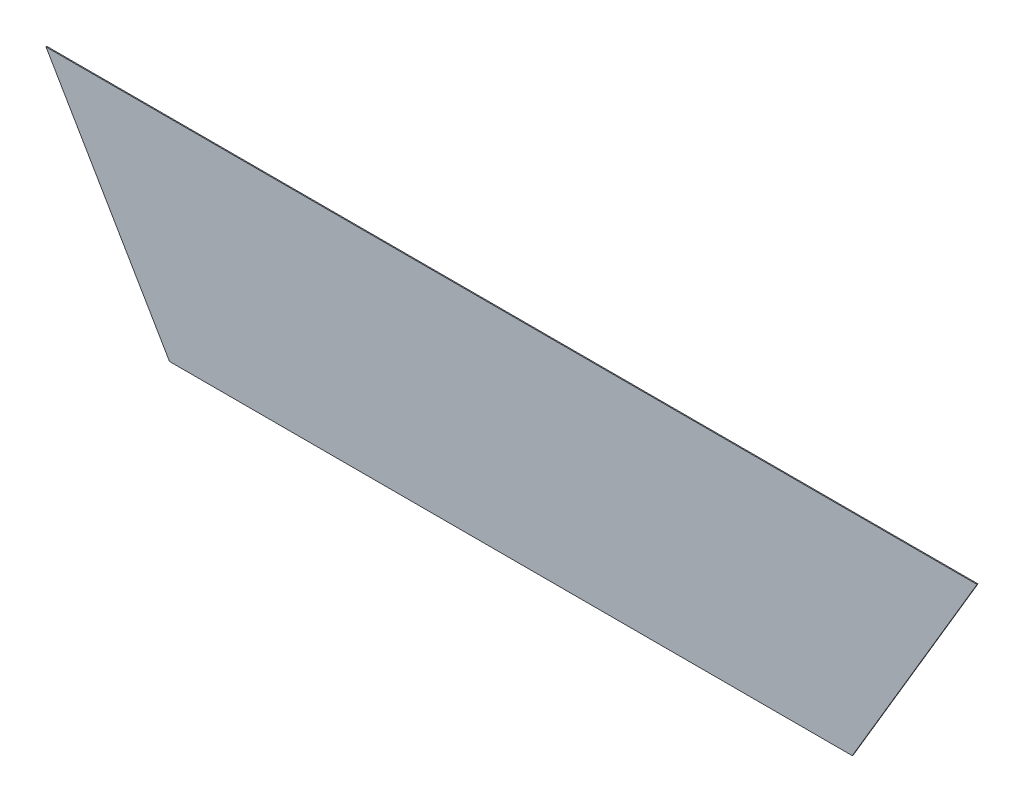
ISO-10303-21;
HEADER;
FILE_DESCRIPTION(('STEP AP214'),'2;1');
FILE_NAME('part.step','',(''),(''),'','','');
FILE_SCHEMA(('AUTOMOTIVE_DESIGN { 1 0 10303 214 1 1 1 1 }'));
ENDSEC;
DATA;
#1=APPLICATION_CONTEXT('core data for automotive mechanical design processes');
#2=APPLICATION_PROTOCOL_DEFINITION('international standard','automotive_design',2000,#1);
#3=PRODUCT_CONTEXT('',#1,'mechanical');
#4=PRODUCT('Part','Part','',(#3));
#5=PRODUCT_RELATED_PRODUCT_CATEGORY('part','',(#4));
#6=PRODUCT_DEFINITION_FORMATION('','',#4);
#7=PRODUCT_DEFINITION_CONTEXT('part definition',#1,'design');
#8=PRODUCT_DEFINITION('design','',#6,#7);
#9=PRODUCT_DEFINITION_SHAPE('','',#8);
#10=(LENGTH_UNIT() NAMED_UNIT(*) SI_UNIT(.MILLI.,.METRE.));
#11=(NAMED_UNIT(*) PLANE_ANGLE_UNIT() SI_UNIT($,.RADIAN.));
#12=(NAMED_UNIT(*) SI_UNIT($,.STERADIAN.) SOLID_ANGLE_UNIT());
#13=UNCERTAINTY_MEASURE_WITH_UNIT(LENGTH_MEASURE(1.E-05),#10,'distance_accuracy_value','');
#14=(GEOMETRIC_REPRESENTATION_CONTEXT(3) GLOBAL_UNCERTAINTY_ASSIGNED_CONTEXT((#13)) GLOBAL_UNIT_ASSIGNED_CONTEXT((#10,
#11,#12)) REPRESENTATION_CONTEXT('',''));
#15=CARTESIAN_POINT('',(0.,0.,0.));
#16=DIRECTION('',(0.,0.,1.));
#17=DIRECTION('',(1.,0.,0.));
#18=AXIS2_PLACEMENT_3D('',#15,#16,#17);
#19=CARTESIAN_POINT('',(-0.425915248074,0.86354947584695,0.0009));
#20=DIRECTION('',(-0.862752742691062,-0.50562605251218,0.));
#21=DIRECTION('',(0.,0.,1.));
#22=AXIS2_PLACEMENT_3D('',#19,#20,#21);
#23=PLANE('',#22);
#24=DIRECTION('',(0.,1.2335811384724E-13,1.));
#25=VECTOR('',#24,1.);
#26=CARTESIAN_POINT('',(-0.3676908598239,0.7642008556469,0.));
#27=LINE('',#26,#25);
#28=CARTESIAN_POINT('',(-0.3676908598239,0.7642008556469,0.));
#29=VERTEX_POINT('',#28);
#30=CARTESIAN_POINT('',(-0.3676908598239,0.7642008556469,0.0009));
#31=VERTEX_POINT('',#30);
#32=EDGE_CURVE('E11',#29,#31,#27,.T.);
#33=ORIENTED_EDGE('',*,*,#32,.T.);
#34=DIRECTION('',(-0.505626052512179,0.862752742691063,0.));
#35=VECTOR('',#34,1.);
#36=CARTESIAN_POINT('',(-0.3676908598239,0.7642008556469,0.0009));
#37=LINE('',#36,#35);
#38=CARTESIAN_POINT('',(-0.4841396363241,0.962898096047,0.0009));
#39=VERTEX_POINT('',#38);
#40=EDGE_CURVE('E86',#31,#39,#37,.T.);
#41=ORIENTED_EDGE('',*,*,#40,.T.);
#42=DIRECTION('',(0.,0.,1.));
#43=VECTOR('',#42,1.);
#44=CARTESIAN_POINT('',(-0.4841396363241,0.962898096047,0.));
#45=LINE('',#44,#43);
#46=CARTESIAN_POINT('',(-0.4841396363241,0.962898096047,0.));
#47=VERTEX_POINT('',#46);
#48=EDGE_CURVE('E24',#47,#39,#45,.T.);
#49=ORIENTED_EDGE('',*,*,#48,.F.);
#50=DIRECTION('',(-0.505626052512179,0.862752742691063,0.));
#51=VECTOR('',#50,1.);
#52=CARTESIAN_POINT('',(-0.3676908598239,0.7642008556469,0.));
#53=LINE('',#52,#51);
#54=EDGE_CURVE('E80',#29,#47,#53,.T.);
#55=ORIENTED_EDGE('',*,*,#54,.F.);
#56=EDGE_LOOP('',(#33,#41,#49,#55));
#57=FACE_BOUND('',#56,.T.);
#58=ADVANCED_FACE('F17',(#57),#23,.T.);
#59=CARTESIAN_POINT('',(-0.0451418287740002,0.962898096047,0.0009));
#60=DIRECTION('',(0.,1.,0.));
#61=DIRECTION('',(0.,0.,1.));
#62=AXIS2_PLACEMENT_3D('',#59,#60,#61);
#63=PLANE('',#62);
#64=ORIENTED_EDGE('',*,*,#48,.T.);
#65=DIRECTION('',(1.,0.,0.));
#66=VECTOR('',#65,1.);
#67=CARTESIAN_POINT('',(-0.4841396363241,0.962898096047,0.0009));
#68=LINE('',#67,#66);
#69=CARTESIAN_POINT('',(0.3938559787761,0.962898096047,0.0009));
#70=VERTEX_POINT('',#69);
#71=EDGE_CURVE('E64',#39,#70,#68,.T.);
#72=ORIENTED_EDGE('',*,*,#71,.T.);
#73=DIRECTION('',(0.,0.,1.));
#74=VECTOR('',#73,1.);
#75=CARTESIAN_POINT('',(0.3938559787761,0.962898096047,0.));
#76=LINE('',#75,#74);
#77=CARTESIAN_POINT('',(0.3938559787761,0.962898096047,0.));
#78=VERTEX_POINT('',#77);
#79=EDGE_CURVE('E84',#78,#70,#76,.T.);
#80=ORIENTED_EDGE('',*,*,#79,.F.);
#81=DIRECTION('',(1.,0.,0.));
#82=VECTOR('',#81,1.);
#83=CARTESIAN_POINT('',(-0.4841396363241,0.962898096047,0.));
#84=LINE('',#83,#82);
#85=EDGE_CURVE('E72',#47,#78,#84,.T.);
#86=ORIENTED_EDGE('',*,*,#85,.F.);
#87=EDGE_LOOP('',(#64,#72,#80,#86));
#88=FACE_BOUND('',#87,.T.);
#89=ADVANCED_FACE('F91',(#88),#63,.T.);
#90=CARTESIAN_POINT('',(0.3350188345761,0.86354947584695,0.0009));
#91=DIRECTION('',(0.860428671084323,-0.509570899852087,0.));
#92=DIRECTION('',(0.,0.,-1.));
#93=AXIS2_PLACEMENT_3D('',#90,#91,#92);
#94=PLANE('',#93);
#95=ORIENTED_EDGE('',*,*,#79,.T.);
#96=DIRECTION('',(-0.509570899852087,-0.860428671084323,0.));
#97=VECTOR('',#96,1.);
#98=CARTESIAN_POINT('',(0.3938559787761,0.962898096047,0.0009));
#99=LINE('',#98,#97);
#100=CARTESIAN_POINT('',(0.2761816903761,0.7642008556469,0.0009));
#101=VERTEX_POINT('',#100);
#102=EDGE_CURVE('E60',#70,#101,#99,.T.);
#103=ORIENTED_EDGE('',*,*,#102,.T.);
#104=DIRECTION('',(0.,1.2335811384724E-13,1.));
#105=VECTOR('',#104,1.);
#106=CARTESIAN_POINT('',(0.2761816903761,0.7642008556469,0.));
#107=LINE('',#106,#105);
#108=CARTESIAN_POINT('',(0.2761816903761,0.7642008556469,0.));
#109=VERTEX_POINT('',#108);
#110=EDGE_CURVE('E55',#109,#101,#107,.T.);
#111=ORIENTED_EDGE('',*,*,#110,.F.);
#112=DIRECTION('',(-0.509570899852087,-0.860428671084323,0.));
#113=VECTOR('',#112,1.);
#114=CARTESIAN_POINT('',(0.3938559787761,0.962898096047,0.));
#115=LINE('',#114,#113);
#116=EDGE_CURVE('E58',#78,#109,#115,.T.);
#117=ORIENTED_EDGE('',*,*,#116,.F.);
#118=EDGE_LOOP('',(#95,#103,#111,#117));
#119=FACE_BOUND('',#118,.T.);
#120=ADVANCED_FACE('F57',(#119),#94,.T.);
#121=CARTESIAN_POINT('',(-0.0457545847239001,0.7642008556469,0.0009));
#122=DIRECTION('',(0.,-1.,0.));
#123=DIRECTION('',(0.,0.,-1.));
#124=AXIS2_PLACEMENT_3D('',#121,#122,#123);
#125=PLANE('',#124);
#126=ORIENTED_EDGE('',*,*,#110,.T.);
#127=DIRECTION('',(-1.,0.,0.));
#128=VECTOR('',#127,1.);
#129=CARTESIAN_POINT('',(0.2761816903761,0.7642008556469,0.0009));
#130=LINE('',#129,#128);
#131=EDGE_CURVE('E78',#101,#31,#130,.T.);
#132=ORIENTED_EDGE('',*,*,#131,.T.);
#133=ORIENTED_EDGE('',*,*,#32,.F.);
#134=DIRECTION('',(-1.,0.,0.));
#135=VECTOR('',#134,1.);
#136=CARTESIAN_POINT('',(0.2761816903761,0.7642008556469,0.));
#137=LINE('',#136,#135);
#138=EDGE_CURVE('E71',#109,#29,#137,.T.);
#139=ORIENTED_EDGE('',*,*,#138,.F.);
#140=EDGE_LOOP('',(#126,#132,#133,#139));
#141=FACE_BOUND('',#140,.T.);
#142=ADVANCED_FACE('F74',(#141),#125,.T.);
#143=CARTESIAN_POINT('',(-0.0451418287740002,0.7642008556469,0.));
#144=DIRECTION('',(0.,0.,1.));
#145=DIRECTION('',(1.,0.,0.));
#146=AXIS2_PLACEMENT_3D('',#143,#144,#145);
#147=PLANE('',#146);
#148=ORIENTED_EDGE('',*,*,#54,.T.);
#149=ORIENTED_EDGE('',*,*,#85,.T.);
#150=ORIENTED_EDGE('',*,*,#116,.T.);
#151=ORIENTED_EDGE('',*,*,#138,.T.);
#152=EDGE_LOOP('',(#148,#149,#150,#151));
#153=FACE_BOUND('',#152,.T.);
#154=ADVANCED_FACE('F70',(#153),#147,.F.);
#155=CARTESIAN_POINT('',(-0.0451418287740002,0.7642008556469,0.0009));
#156=DIRECTION('',(0.,0.,1.));
#157=DIRECTION('',(1.,0.,0.));
#158=AXIS2_PLACEMENT_3D('',#155,#156,#157);
#159=PLANE('',#158);
#160=ORIENTED_EDGE('',*,*,#40,.F.);
#161=ORIENTED_EDGE('',*,*,#131,.F.);
#162=ORIENTED_EDGE('',*,*,#102,.F.);
#163=ORIENTED_EDGE('',*,*,#71,.F.);
#164=EDGE_LOOP('',(#160,#161,#162,#163));
#165=FACE_BOUND('',#164,.T.);
#166=ADVANCED_FACE('F90',(#165),#159,.T.);
#167=CLOSED_SHELL('',(#58,#89,#120,#142,#154,#166));
#168=MANIFOLD_SOLID_BREP('B1',#167);
#169=ADVANCED_BREP_SHAPE_REPRESENTATION('',(#18,#168),#14);
#170=SHAPE_DEFINITION_REPRESENTATION(#9,#169);
ENDSEC;
END-ISO-10303-21;
